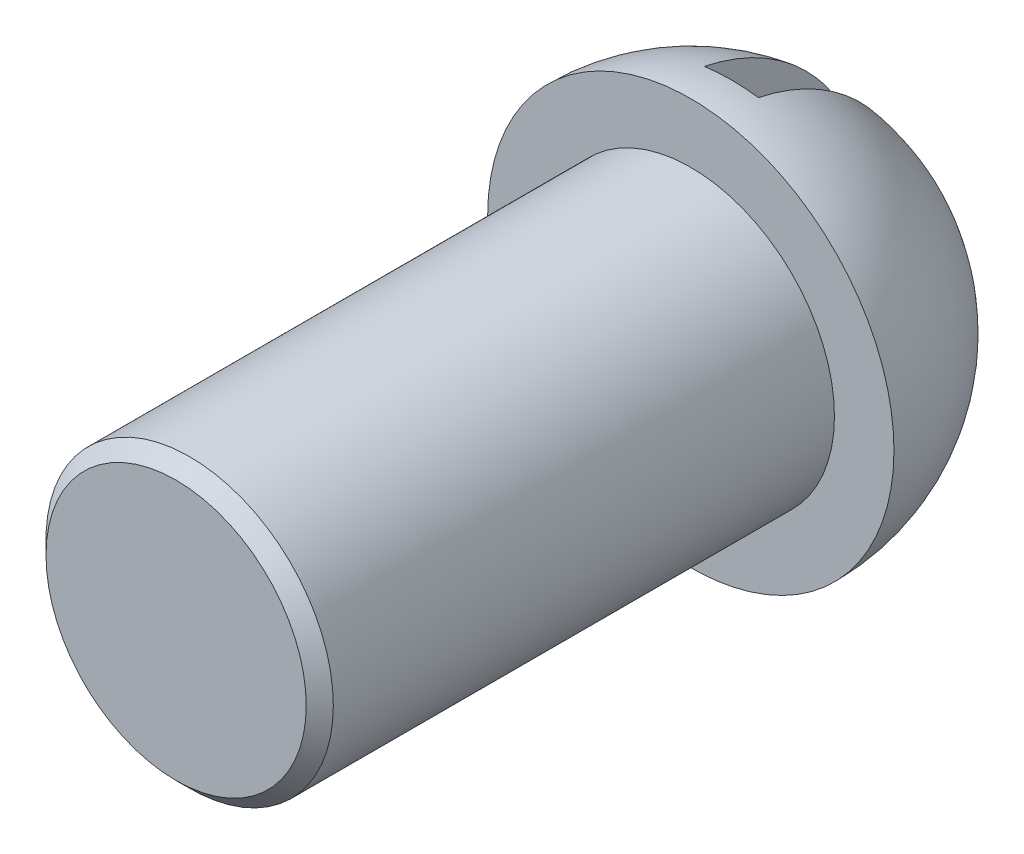
ISO-10303-21;
HEADER;
FILE_DESCRIPTION(('STEP AP214'),'2;1');
FILE_NAME('part.step','',(''),(''),'','','');
FILE_SCHEMA(('AUTOMOTIVE_DESIGN { 1 0 10303 214 1 1 1 1 }'));
ENDSEC;
DATA;
#1=APPLICATION_CONTEXT('core data for automotive mechanical design processes');
#2=APPLICATION_PROTOCOL_DEFINITION('international standard','automotive_design',2000,#1);
#3=PRODUCT_CONTEXT('',#1,'mechanical');
#4=PRODUCT('Part','Part','',(#3));
#5=PRODUCT_RELATED_PRODUCT_CATEGORY('part','',(#4));
#6=PRODUCT_DEFINITION_FORMATION('','',#4);
#7=PRODUCT_DEFINITION_CONTEXT('part definition',#1,'design');
#8=PRODUCT_DEFINITION('design','',#6,#7);
#9=PRODUCT_DEFINITION_SHAPE('','',#8);
#10=(LENGTH_UNIT() NAMED_UNIT(*) SI_UNIT(.MILLI.,.METRE.));
#11=(NAMED_UNIT(*) PLANE_ANGLE_UNIT() SI_UNIT($,.RADIAN.));
#12=(NAMED_UNIT(*) SI_UNIT($,.STERADIAN.) SOLID_ANGLE_UNIT());
#13=UNCERTAINTY_MEASURE_WITH_UNIT(LENGTH_MEASURE(1.E-05),#10,'distance_accuracy_value','');
#14=(GEOMETRIC_REPRESENTATION_CONTEXT(3) GLOBAL_UNCERTAINTY_ASSIGNED_CONTEXT((#13)) GLOBAL_UNIT_ASSIGNED_CONTEXT((#10,
#11,#12)) REPRESENTATION_CONTEXT('',''));
#15=CARTESIAN_POINT('',(0.,0.,0.));
#16=DIRECTION('',(0.,0.,1.));
#17=DIRECTION('',(1.,0.,0.));
#18=AXIS2_PLACEMENT_3D('',#15,#16,#17);
#19=CARTESIAN_POINT('',(-2.42861286636753E-13,0.,-37.9999999999998));
#20=DIRECTION('',(0.,0.,1.));
#21=DIRECTION('',(1.,0.,0.));
#22=AXIS2_PLACEMENT_3D('',#19,#20,#21);
#23=SPHERICAL_SURFACE('',#22,15.0000000000002);
#24=CARTESIAN_POINT('',(0.,0.,-38.));
#25=DIRECTION('',(0.,0.,1.));
#26=DIRECTION('',(1.,0.,0.));
#27=AXIS2_PLACEMENT_3D('',#24,#25,#26);
#28=CIRCLE('',#27,15.);
#29=CARTESIAN_POINT('',(15.,0.,-38.));
#30=VERTEX_POINT('',#29);
#31=EDGE_CURVE('E78',#30,#30,#28,.T.);
#32=ORIENTED_EDGE('',*,*,#31,.F.);
#33=EDGE_LOOP('',(#32));
#34=FACE_BOUND('',#33,.T.);
#35=CARTESIAN_POINT('',(-2.00236925240819,0.,-37.9999999999998));
#36=DIRECTION('',(1.,0.,0.));
#37=DIRECTION('',(0.,0.,-1.));
#38=AXIS2_PLACEMENT_3D('',#35,#36,#37);
#39=CIRCLE('',#38,14.8657498087725);
#40=CARTESIAN_POINT('',(-2.00236925240819,14.5598941403094,-41.));
#41=VERTEX_POINT('',#40);
#42=CARTESIAN_POINT('',(-2.00236925240819,-14.5598941403094,-41.));
#43=VERTEX_POINT('',#42);
#44=EDGE_CURVE('E75',#41,#43,#39,.F.);
#45=ORIENTED_EDGE('',*,*,#44,.T.);
#46=CARTESIAN_POINT('',(-2.42861286636753E-13,0.,-41.));
#47=DIRECTION('',(0.,0.,-1.));
#48=DIRECTION('',(-1.,0.,0.));
#49=AXIS2_PLACEMENT_3D('',#46,#47,#48);
#50=CIRCLE('',#49,14.6969384566993);
#51=CARTESIAN_POINT('',(1.99349803897627,-14.5611114125469,-41.));
#52=VERTEX_POINT('',#51);
#53=EDGE_CURVE('E70',#43,#52,#50,.F.);
#54=ORIENTED_EDGE('',*,*,#53,.T.);
#55=CARTESIAN_POINT('',(1.99349803897627,0.,-37.9999999999998));
#56=DIRECTION('',(-1.,0.,0.));
#57=DIRECTION('',(0.,0.,1.));
#58=AXIS2_PLACEMENT_3D('',#55,#56,#57);
#59=CIRCLE('',#58,14.8669420382473);
#60=CARTESIAN_POINT('',(1.99349803897627,0.,-52.8669420382469));
#61=VERTEX_POINT('',#60);
#62=EDGE_CURVE('E52',#52,#61,#59,.F.);
#63=ORIENTED_EDGE('',*,*,#62,.T.);
#64=CARTESIAN_POINT('',(1.99349803897627,14.5611114125469,-41.));
#65=VERTEX_POINT('',#64);
#66=EDGE_CURVE('E48',#61,#65,#59,.F.);
#67=ORIENTED_EDGE('',*,*,#66,.T.);
#68=EDGE_CURVE('E68',#65,#41,#50,.F.);
#69=ORIENTED_EDGE('',*,*,#68,.T.);
#70=EDGE_LOOP('',(#45,#54,#63,#67,#69));
#71=FACE_BOUND('',#70,.T.);
#72=ADVANCED_FACE('F33',(#34,#71),#23,.T.);
#73=CARTESIAN_POINT('',(0.,0.,0.));
#74=DIRECTION('',(0.,0.,1.));
#75=DIRECTION('',(1.,0.,0.));
#76=AXIS2_PLACEMENT_3D('',#73,#74,#75);
#77=PLANE('',#76);
#78=CARTESIAN_POINT('',(0.,0.,0.));
#79=DIRECTION('',(0.,0.,1.));
#80=DIRECTION('',(1.,0.,0.));
#81=AXIS2_PLACEMENT_3D('',#78,#79,#80);
#82=CIRCLE('',#81,9.60660171779815);
#83=CARTESIAN_POINT('',(9.60660171779815,0.,0.));
#84=VERTEX_POINT('',#83);
#85=EDGE_CURVE('E41',#84,#84,#82,.T.);
#86=ORIENTED_EDGE('',*,*,#85,.T.);
#87=EDGE_LOOP('',(#86));
#88=FACE_BOUND('',#87,.T.);
#89=ADVANCED_FACE('F90',(#88),#77,.T.);
#90=CARTESIAN_POINT('',(10.6066017177981,0.,-38.));
#91=DIRECTION('',(0.,0.,1.));
#92=DIRECTION('',(1.,0.,0.));
#93=AXIS2_PLACEMENT_3D('',#90,#91,#92);
#94=PLANE('',#93);
#95=ORIENTED_EDGE('',*,*,#31,.T.);
#96=EDGE_LOOP('',(#95));
#97=FACE_BOUND('',#96,.T.);
#98=CARTESIAN_POINT('',(0.,0.,-38.));
#99=DIRECTION('',(0.,0.,1.));
#100=DIRECTION('',(1.,0.,0.));
#101=AXIS2_PLACEMENT_3D('',#98,#99,#100);
#102=CIRCLE('',#101,10.6066017177981);
#103=CARTESIAN_POINT('',(10.6066017177981,0.,-38.));
#104=VERTEX_POINT('',#103);
#105=EDGE_CURVE('E81',#104,#104,#102,.T.);
#106=ORIENTED_EDGE('',*,*,#105,.F.);
#107=EDGE_LOOP('',(#106));
#108=FACE_BOUND('',#107,.T.);
#109=ADVANCED_FACE('F105',(#97,#108),#94,.T.);
#110=CARTESIAN_POINT('',(0.,0.,0.));
#111=DIRECTION('',(0.,0.,1.));
#112=DIRECTION('',(1.,0.,0.));
#113=AXIS2_PLACEMENT_3D('',#110,#111,#112);
#114=CYLINDRICAL_SURFACE('',#113,10.6066017177981);
#115=CARTESIAN_POINT('',(0.,0.,-0.999999999999987));
#116=DIRECTION('',(0.,0.,1.));
#117=DIRECTION('',(1.,0.,0.));
#118=AXIS2_PLACEMENT_3D('',#115,#116,#117);
#119=CIRCLE('',#118,10.6066017177981);
#120=CARTESIAN_POINT('',(10.6066017177981,0.,-0.999999999999987));
#121=VERTEX_POINT('',#120);
#122=EDGE_CURVE('E11',#121,#121,#119,.F.);
#123=ORIENTED_EDGE('',*,*,#122,.T.);
#124=EDGE_LOOP('',(#123));
#125=FACE_BOUND('',#124,.T.);
#126=ORIENTED_EDGE('',*,*,#105,.T.);
#127=EDGE_LOOP('',(#126));
#128=FACE_BOUND('',#127,.T.);
#129=ADVANCED_FACE('F111',(#125,#128),#114,.T.);
#130=CARTESIAN_POINT('',(-2.00236925240819,17.,-41.));
#131=DIRECTION('',(0.,0.,-1.));
#132=DIRECTION('',(-1.,0.,0.));
#133=AXIS2_PLACEMENT_3D('',#130,#131,#132);
#134=PLANE('',#133);
#135=DIRECTION('',(0.,-1.,0.));
#136=VECTOR('',#135,1.);
#137=CARTESIAN_POINT('',(-2.00236925240819,17.,-41.));
#138=LINE('',#137,#136);
#139=EDGE_CURVE('E65',#41,#43,#138,.T.);
#140=ORIENTED_EDGE('',*,*,#139,.F.);
#141=ORIENTED_EDGE('',*,*,#68,.F.);
#142=DIRECTION('',(0.,-1.,0.));
#143=VECTOR('',#142,1.);
#144=CARTESIAN_POINT('',(1.99349803897627,17.,-41.));
#145=LINE('',#144,#143);
#146=EDGE_CURVE('E73',#65,#52,#145,.T.);
#147=ORIENTED_EDGE('',*,*,#146,.T.);
#148=ORIENTED_EDGE('',*,*,#53,.F.);
#149=EDGE_LOOP('',(#140,#141,#147,#148));
#150=FACE_BOUND('',#149,.T.);
#151=ADVANCED_FACE('F67',(#150),#134,.T.);
#152=CARTESIAN_POINT('',(-2.00236925240819,17.,-52.8669420382469));
#153=DIRECTION('',(1.,0.,0.));
#154=DIRECTION('',(0.,0.,-1.));
#155=AXIS2_PLACEMENT_3D('',#152,#153,#154);
#156=PLANE('',#155);
#157=ORIENTED_EDGE('',*,*,#139,.T.);
#158=ORIENTED_EDGE('',*,*,#44,.F.);
#159=EDGE_LOOP('',(#157,#158));
#160=FACE_BOUND('',#159,.T.);
#161=ADVANCED_FACE('F76',(#160),#156,.T.);
#162=CARTESIAN_POINT('',(1.99349803897627,17.,-41.));
#163=DIRECTION('',(-1.,0.,0.));
#164=DIRECTION('',(0.,0.,1.));
#165=AXIS2_PLACEMENT_3D('',#162,#163,#164);
#166=PLANE('',#165);
#167=ORIENTED_EDGE('',*,*,#146,.F.);
#168=ORIENTED_EDGE('',*,*,#66,.F.);
#169=ORIENTED_EDGE('',*,*,#62,.F.);
#170=EDGE_LOOP('',(#167,#168,#169));
#171=FACE_BOUND('',#170,.T.);
#172=ADVANCED_FACE('F93',(#171),#166,.T.);
#173=CARTESIAN_POINT('',(0.,0.,0.));
#174=DIRECTION('',(0.,0.,-1.));
#175=DIRECTION('',(-1.,0.,0.));
#176=AXIS2_PLACEMENT_3D('',#173,#174,#175);
#177=CONICAL_SURFACE('',#176,9.60660171779815,0.785398163397447);
#178=ORIENTED_EDGE('',*,*,#122,.F.);
#179=EDGE_LOOP('',(#178));
#180=FACE_BOUND('',#179,.T.);
#181=ORIENTED_EDGE('',*,*,#85,.F.);
#182=EDGE_LOOP('',(#181));
#183=FACE_BOUND('',#182,.T.);
#184=ADVANCED_FACE('F35',(#180,#183),#177,.T.);
#185=CLOSED_SHELL('',(#72,#89,#109,#129,#151,#161,#172,#184));
#186=MANIFOLD_SOLID_BREP('B2',#185);
#187=ADVANCED_BREP_SHAPE_REPRESENTATION('',(#18,#186),#14);
#188=SHAPE_DEFINITION_REPRESENTATION(#9,#187);
ENDSEC;
END-ISO-10303-21;
